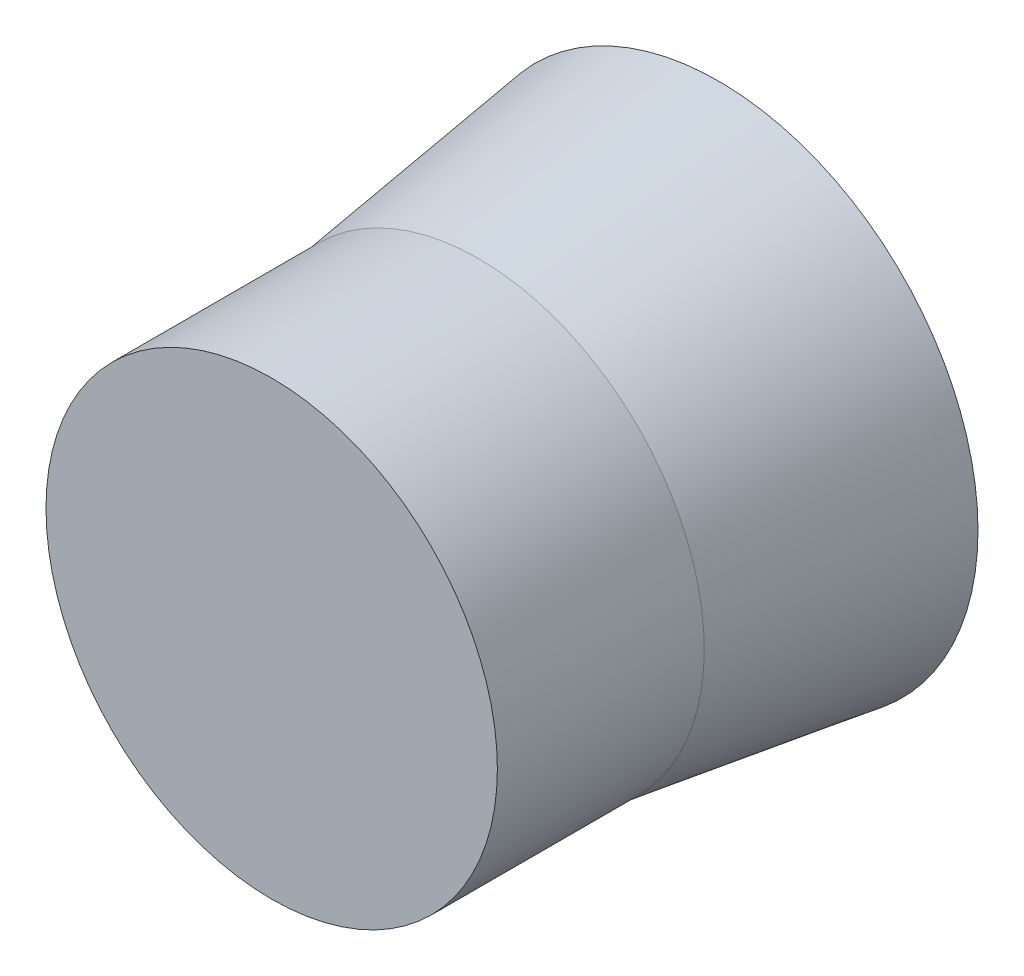
ISO-10303-21;
HEADER;
FILE_DESCRIPTION(('STEP AP214'),'2;1');
FILE_NAME('part.step','',(''),(''),'','','');
FILE_SCHEMA(('AUTOMOTIVE_DESIGN { 1 0 10303 214 1 1 1 1 }'));
ENDSEC;
DATA;
#1=APPLICATION_CONTEXT('core data for automotive mechanical design processes');
#2=APPLICATION_PROTOCOL_DEFINITION('international standard','automotive_design',2000,#1);
#3=PRODUCT_CONTEXT('',#1,'mechanical');
#4=PRODUCT('Part','Part','',(#3));
#5=PRODUCT_RELATED_PRODUCT_CATEGORY('part','',(#4));
#6=PRODUCT_DEFINITION_FORMATION('','',#4);
#7=PRODUCT_DEFINITION_CONTEXT('part definition',#1,'design');
#8=PRODUCT_DEFINITION('design','',#6,#7);
#9=PRODUCT_DEFINITION_SHAPE('','',#8);
#10=(LENGTH_UNIT() NAMED_UNIT(*) SI_UNIT(.MILLI.,.METRE.));
#11=(NAMED_UNIT(*) PLANE_ANGLE_UNIT() SI_UNIT($,.RADIAN.));
#12=(NAMED_UNIT(*) SI_UNIT($,.STERADIAN.) SOLID_ANGLE_UNIT());
#13=UNCERTAINTY_MEASURE_WITH_UNIT(LENGTH_MEASURE(1.E-05),#10,'distance_accuracy_value','');
#14=(GEOMETRIC_REPRESENTATION_CONTEXT(3) GLOBAL_UNCERTAINTY_ASSIGNED_CONTEXT((#13)) GLOBAL_UNIT_ASSIGNED_CONTEXT((#10,
#11,#12)) REPRESENTATION_CONTEXT('',''));
#15=CARTESIAN_POINT('',(0.,0.,0.));
#16=DIRECTION('',(0.,0.,1.));
#17=DIRECTION('',(1.,0.,0.));
#18=AXIS2_PLACEMENT_3D('',#15,#16,#17);
#19=CARTESIAN_POINT('',(0.,0.,0.));
#20=DIRECTION('',(0.,0.,-1.));
#21=DIRECTION('',(-1.,0.,0.));
#22=AXIS2_PLACEMENT_3D('',#19,#20,#21);
#23=PLANE('',#22);
#24=CARTESIAN_POINT('',(0.,0.,0.));
#25=DIRECTION('',(0.,0.,1.));
#26=DIRECTION('',(1.,0.,0.));
#27=AXIS2_PLACEMENT_3D('',#24,#25,#26);
#28=CIRCLE('',#27,104.999999995413);
#29=CARTESIAN_POINT('',(104.999999995413,0.,0.));
#30=VERTEX_POINT('',#29);
#31=EDGE_CURVE('E10',#30,#30,#28,.T.);
#32=ORIENTED_EDGE('',*,*,#31,.T.);
#33=EDGE_LOOP('',(#32));
#34=FACE_BOUND('',#33,.T.);
#35=ADVANCED_FACE('F31',(#34),#23,.F.);
#36=CARTESIAN_POINT('',(0.,0.,0.));
#37=DIRECTION('',(0.,0.,1.));
#38=DIRECTION('',(1.,0.,0.));
#39=AXIS2_PLACEMENT_3D('',#36,#37,#38);
#40=CYLINDRICAL_SURFACE('',#39,104.999999995413);
#41=ORIENTED_EDGE('',*,*,#31,.F.);
#42=EDGE_LOOP('',(#41));
#43=FACE_BOUND('',#42,.T.);
#44=CARTESIAN_POINT('',(0.,0.,-96.2579512063937));
#45=DIRECTION('',(0.,0.,1.));
#46=DIRECTION('',(1.,0.,0.));
#47=AXIS2_PLACEMENT_3D('',#44,#45,#46);
#48=CIRCLE('',#47,104.999999995413);
#49=CARTESIAN_POINT('',(104.999999995413,0.,-96.2579512063937));
#50=VERTEX_POINT('',#49);
#51=EDGE_CURVE('E37',#50,#50,#48,.T.);
#52=ORIENTED_EDGE('',*,*,#51,.T.);
#53=EDGE_LOOP('',(#52));
#54=FACE_BOUND('',#53,.T.);
#55=ADVANCED_FACE('F66',(#43,#54),#40,.T.);
#56=CARTESIAN_POINT('',(0.,0.,-208.));
#57=DIRECTION('',(0.,0.,-1.));
#58=DIRECTION('',(-1.,0.,0.));
#59=AXIS2_PLACEMENT_3D('',#56,#57,#58);
#60=CONICAL_SURFACE('',#59,120.615384610115,0.138845764483334);
#61=ORIENTED_EDGE('',*,*,#51,.F.);
#62=EDGE_LOOP('',(#61));
#63=FACE_BOUND('',#62,.T.);
#64=CARTESIAN_POINT('',(0.,0.,-208.));
#65=DIRECTION('',(0.,0.,1.));
#66=DIRECTION('',(1.,0.,0.));
#67=AXIS2_PLACEMENT_3D('',#64,#65,#66);
#68=CIRCLE('',#67,120.615384610115);
#69=CARTESIAN_POINT('',(120.615384610115,0.,-208.));
#70=VERTEX_POINT('',#69);
#71=EDGE_CURVE('E41',#70,#70,#68,.T.);
#72=ORIENTED_EDGE('',*,*,#71,.T.);
#73=EDGE_LOOP('',(#72));
#74=FACE_BOUND('',#73,.T.);
#75=ADVANCED_FACE('F70',(#63,#74),#60,.T.);
#76=CARTESIAN_POINT('',(0.,120.615384610115,-208.));
#77=DIRECTION('',(0.,0.,1.));
#78=DIRECTION('',(1.,0.,0.));
#79=AXIS2_PLACEMENT_3D('',#76,#77,#78);
#80=PLANE('',#79);
#81=ORIENTED_EDGE('',*,*,#71,.F.);
#82=EDGE_LOOP('',(#81));
#83=FACE_BOUND('',#82,.T.);
#84=CARTESIAN_POINT('',(0.,0.,-208.));
#85=DIRECTION('',(0.,0.,1.));
#86=DIRECTION('',(1.,0.,0.));
#87=AXIS2_PLACEMENT_3D('',#84,#85,#86);
#88=CIRCLE('',#87,44.615384610115);
#89=CARTESIAN_POINT('',(44.615384610115,0.,-208.));
#90=VERTEX_POINT('',#89);
#91=EDGE_CURVE('E45',#90,#90,#88,.T.);
#92=ORIENTED_EDGE('',*,*,#91,.T.);
#93=EDGE_LOOP('',(#92));
#94=FACE_BOUND('',#93,.T.);
#95=ADVANCED_FACE('F62',(#83,#94),#80,.F.);
#96=CARTESIAN_POINT('',(0.,0.,-232.));
#97=DIRECTION('',(0.,0.,1.));
#98=DIRECTION('',(1.,0.,0.));
#99=AXIS2_PLACEMENT_3D('',#96,#97,#98);
#100=CONICAL_SURFACE('',#99,34.,0.41643861700795);
#101=ORIENTED_EDGE('',*,*,#91,.F.);
#102=EDGE_LOOP('',(#101));
#103=FACE_BOUND('',#102,.T.);
#104=CARTESIAN_POINT('',(0.,0.,-232.));
#105=DIRECTION('',(0.,0.,1.));
#106=DIRECTION('',(1.,0.,0.));
#107=AXIS2_PLACEMENT_3D('',#104,#105,#106);
#108=CIRCLE('',#107,34.);
#109=CARTESIAN_POINT('',(34.,0.,-232.));
#110=VERTEX_POINT('',#109);
#111=EDGE_CURVE('E50',#110,#110,#108,.T.);
#112=ORIENTED_EDGE('',*,*,#111,.T.);
#113=EDGE_LOOP('',(#112));
#114=FACE_BOUND('',#113,.T.);
#115=ADVANCED_FACE('F54',(#103,#114),#100,.T.);
#116=CARTESIAN_POINT('',(0.,34.,-232.));
#117=DIRECTION('',(0.,0.,1.));
#118=DIRECTION('',(1.,0.,0.));
#119=AXIS2_PLACEMENT_3D('',#116,#117,#118);
#120=PLANE('',#119);
#121=ORIENTED_EDGE('',*,*,#111,.F.);
#122=EDGE_LOOP('',(#121));
#123=FACE_BOUND('',#122,.T.);
#124=ADVANCED_FACE('F56',(#123),#120,.F.);
#125=CLOSED_SHELL('',(#35,#55,#75,#95,#115,#124));
#126=MANIFOLD_SOLID_BREP('B2',#125);
#127=ADVANCED_BREP_SHAPE_REPRESENTATION('',(#18,#126),#14);
#128=SHAPE_DEFINITION_REPRESENTATION(#9,#127);
ENDSEC;
END-ISO-10303-21;
